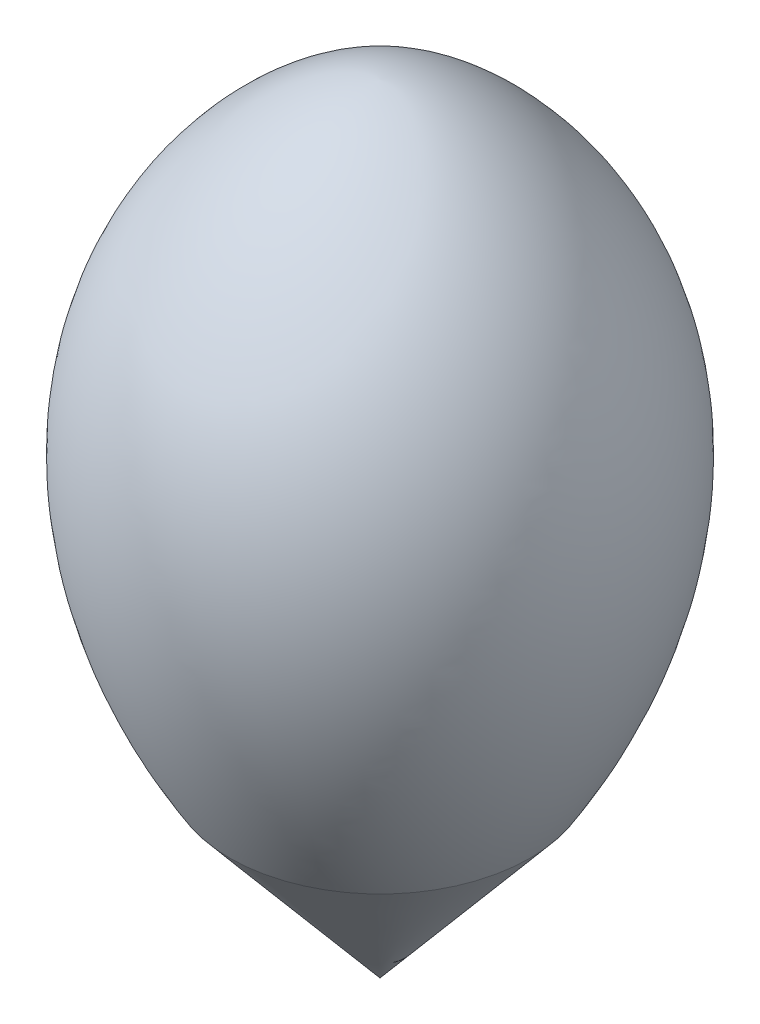
ISO-10303-21;
HEADER;
FILE_DESCRIPTION(('STEP AP214'),'2;1');
FILE_NAME('part.step','',(''),(''),'','','');
FILE_SCHEMA(('AUTOMOTIVE_DESIGN { 1 0 10303 214 1 1 1 1 }'));
ENDSEC;
DATA;
#1=APPLICATION_CONTEXT('core data for automotive mechanical design processes');
#2=APPLICATION_PROTOCOL_DEFINITION('international standard','automotive_design',2000,#1);
#3=PRODUCT_CONTEXT('',#1,'mechanical');
#4=PRODUCT('Part','Part','',(#3));
#5=PRODUCT_RELATED_PRODUCT_CATEGORY('part','',(#4));
#6=PRODUCT_DEFINITION_FORMATION('','',#4);
#7=PRODUCT_DEFINITION_CONTEXT('part definition',#1,'design');
#8=PRODUCT_DEFINITION('design','',#6,#7);
#9=PRODUCT_DEFINITION_SHAPE('','',#8);
#10=(LENGTH_UNIT() NAMED_UNIT(*) SI_UNIT(.MILLI.,.METRE.));
#11=(NAMED_UNIT(*) PLANE_ANGLE_UNIT() SI_UNIT($,.RADIAN.));
#12=(NAMED_UNIT(*) SI_UNIT($,.STERADIAN.) SOLID_ANGLE_UNIT());
#13=UNCERTAINTY_MEASURE_WITH_UNIT(LENGTH_MEASURE(1.E-05),#10,'distance_accuracy_value','');
#14=(GEOMETRIC_REPRESENTATION_CONTEXT(3) GLOBAL_UNCERTAINTY_ASSIGNED_CONTEXT((#13)) GLOBAL_UNIT_ASSIGNED_CONTEXT((#10,
#11,#12)) REPRESENTATION_CONTEXT('',''));
#15=CARTESIAN_POINT('',(0.,0.,0.));
#16=DIRECTION('',(0.,0.,1.));
#17=DIRECTION('',(1.,0.,0.));
#18=AXIS2_PLACEMENT_3D('',#15,#16,#17);
#19=CARTESIAN_POINT('',(0.,99.9934109360128,0.));
#20=CARTESIAN_POINT('',(-9.9934109360128,99.4927834995197,0.));
#21=CARTESIAN_POINT('',(-16.3058972954952,92.4753388844954,0.));
#22=CARTESIAN_POINT('',(-27.0364728476547,85.836141268443,0.));
#23=CARTESIAN_POINT('',(-31.8906604895605,73.361649154837,0.));
#24=CARTESIAN_POINT('',(-33.1226808042732,61.6600810151575,0.));
#25=CARTESIAN_POINT('',(-31.7605429729574,50.8967313862121,0.));
#26=CARTESIAN_POINT('',(-28.8033275489246,40.8620784973844,0.));
#27=CARTESIAN_POINT('',(-24.6113168395501,31.5238957256248,0.));
#28=CARTESIAN_POINT('',(-19.2793929219058,22.9762857777166,0.));
#29=B_SPLINE_CURVE_WITH_KNOTS('',9,(#19,#20,#21,#22,#23,#24,#25,#26,#27,#28),.UNSPECIFIED.,.F.,
.F.,(10,10),(0.,1.),.UNSPECIFIED.);
#30=CARTESIAN_POINT('',(0.,0.,0.));
#31=DIRECTION('',(0.,-1.,0.));
#32=AXIS1_PLACEMENT('',#30,#31);
#33=SURFACE_OF_REVOLUTION('',#29,#32);
#34=CARTESIAN_POINT('',(0.,22.9762857777166,0.));
#35=DIRECTION('',(0.,-1.,0.));
#36=DIRECTION('',(0.,0.,-1.));
#37=AXIS2_PLACEMENT_3D('',#34,#35,#36);
#38=CIRCLE('',#37,19.2793929219058);
#39=CARTESIAN_POINT('',(0.,22.9762857777166,-19.2793929219058));
#40=VERTEX_POINT('',#39);
#41=EDGE_CURVE('E47',#40,#40,#38,.T.);
#42=ORIENTED_EDGE('',*,*,#41,.F.);
#43=EDGE_LOOP('',(#42));
#44=FACE_BOUND('',#43,.T.);
#45=CARTESIAN_POINT('',(0.,99.9934109360128,0.));
#46=VERTEX_POINT('',#45);
#47=VERTEX_LOOP('',#46);
#48=FACE_BOUND('',#47,.T.);
#49=ADVANCED_FACE('F37',(#44,#48),#33,.T.);
#50=CARTESIAN_POINT('',(0.,22.9762857777166,0.));
#51=DIRECTION('',(0.,1.,0.));
#52=DIRECTION('',(0.,0.,1.));
#53=AXIS2_PLACEMENT_3D('',#50,#51,#52);
#54=CONICAL_SURFACE('',#53,19.2793929219058,0.698131700797732);
#55=CARTESIAN_POINT('',(0.,0.,0.));
#56=VERTEX_POINT('',#55);
#57=VERTEX_LOOP('',#56);
#58=FACE_BOUND('',#57,.T.);
#59=ORIENTED_EDGE('',*,*,#41,.T.);
#60=EDGE_LOOP('',(#59));
#61=FACE_BOUND('',#60,.T.);
#62=ADVANCED_FACE('F59',(#58,#61),#54,.T.);
#63=CLOSED_SHELL('',(#49,#62));
#64=CARTESIAN_POINT('',(-0.0126968735217156,99.9927700686131,0.));
#65=CARTESIAN_POINT('',(-10.000543921836,99.484856874839,0.));
#66=CARTESIAN_POINT('',(-16.3165008418341,92.4687743175404,0.));
#67=CARTESIAN_POINT('',(-27.0405841956323,85.8255732039856,0.));
#68=CARTESIAN_POINT('',(-31.8915297709863,73.3533881083392,0.));
#69=CARTESIAN_POINT('',(-33.1219112848734,61.6540020165858,0.));
#70=CARTESIAN_POINT('',(-31.7592902338036,50.8924807867548,0.));
#71=CARTESIAN_POINT('',(-28.8021437129149,40.859441433813,0.));
#72=CARTESIAN_POINT('',(-24.6105639785967,31.522688813847,0.));
#73=CARTESIAN_POINT('',(-19.2793929219058,22.9762857777166,0.));
#74=B_SPLINE_CURVE_WITH_KNOTS('',9,(#64,#65,#66,#67,#68,#69,#70,#71,#72,#73),.UNSPECIFIED.,.F.,
.F.,(10,10),(0.000141198742711686,1.),.UNSPECIFIED.);
#75=CARTESIAN_POINT('',(0.,0.,0.));
#76=DIRECTION('',(0.,-1.,0.));
#77=AXIS1_PLACEMENT('',#75,#76);
#78=SURFACE_OF_REVOLUTION('',#74,#77);
#79=OFFSET_SURFACE('',#78,-0.25,.F.);
#80=CARTESIAN_POINT('',(1.13903908549075E-13,99.7430926979869,0.));
#81=VERTEX_POINT('',#80);
#82=VERTEX_LOOP('',#81);
#83=FACE_BOUND('',#82,.T.);
#84=CARTESIAN_POINT('',(0.,23.1235059899187,0.));
#85=DIRECTION('',(0.,-1.,0.));
#86=DIRECTION('',(0.,0.,-1.));
#87=AXIS2_PLACEMENT_3D('',#84,#85,#86);
#88=CIRCLE('',#87,19.0765735253334);
#89=CARTESIAN_POINT('',(0.,23.1235059899187,-19.0765735253334));
#90=VERTEX_POINT('',#89);
#91=EDGE_CURVE('E11',#90,#90,#88,.T.);
#92=ORIENTED_EDGE('',*,*,#91,.T.);
#93=EDGE_LOOP('',(#92));
#94=FACE_BOUND('',#93,.T.);
#95=ADVANCED_FACE('F70',(#83,#94),#79,.F.);
#96=CARTESIAN_POINT('',(0.,23.1369826801382,0.));
#97=DIRECTION('',(0.,1.,0.));
#98=DIRECTION('',(0.,0.,1.));
#99=AXIS2_PLACEMENT_3D('',#96,#97,#98);
#100=CONICAL_SURFACE('',#99,19.087881811126,0.698131700797732);
#101=CARTESIAN_POINT('',(0.,0.388930956715102,0.));
#102=VERTEX_POINT('',#101);
#103=VERTEX_LOOP('',#102);
#104=FACE_BOUND('',#103,.T.);
#105=ORIENTED_EDGE('',*,*,#91,.F.);
#106=EDGE_LOOP('',(#105));
#107=FACE_BOUND('',#106,.T.);
#108=ADVANCED_FACE('F39',(#104,#107),#100,.F.);
#109=CLOSED_SHELL('',(#95,#108));
#110=ORIENTED_CLOSED_SHELL('',*,#109,.T.);
#111=BREP_WITH_VOIDS('B2',#63,(#110));
#112=ADVANCED_BREP_SHAPE_REPRESENTATION('',(#18,#111),#14);
#113=SHAPE_DEFINITION_REPRESENTATION(#9,#112);
ENDSEC;
END-ISO-10303-21;
